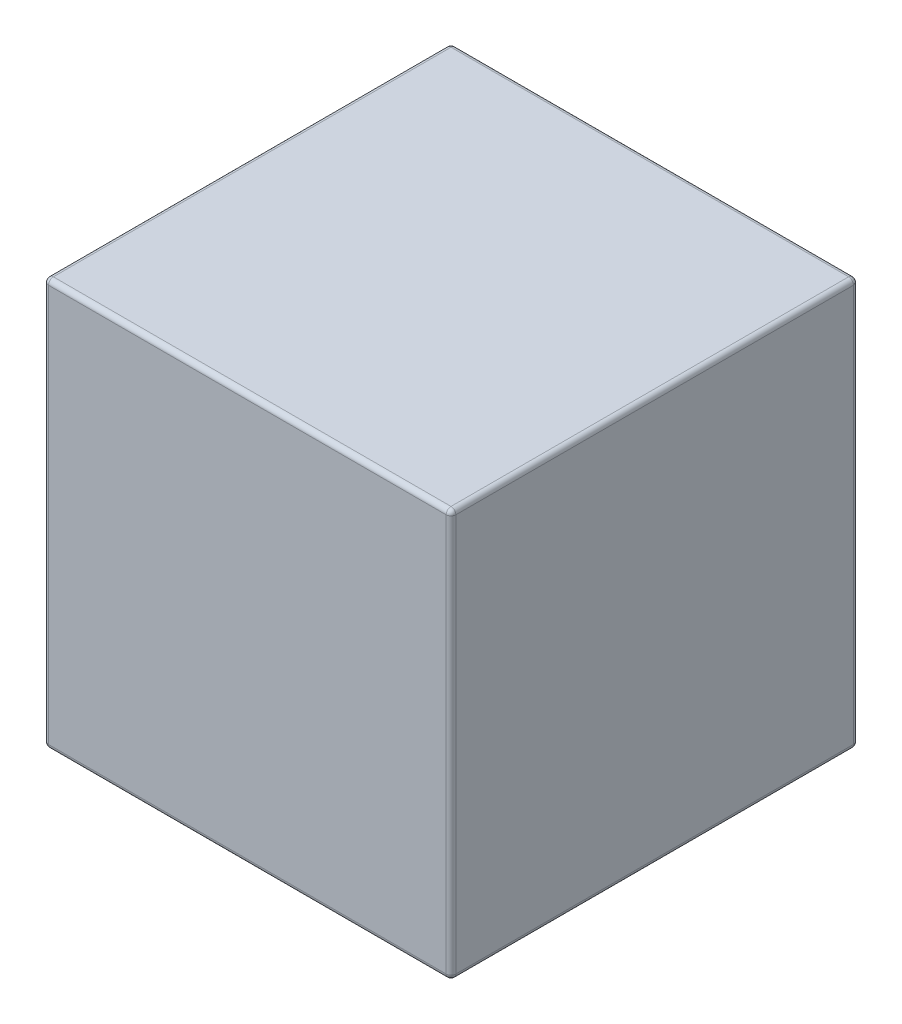
ISO-10303-21;
HEADER;
FILE_DESCRIPTION(('STEP AP214'),'2;1');
FILE_NAME('part.step','',(''),(''),'','','');
FILE_SCHEMA(('AUTOMOTIVE_DESIGN { 1 0 10303 214 1 1 1 1 }'));
ENDSEC;
DATA;
#1=APPLICATION_CONTEXT('core data for automotive mechanical design processes');
#2=APPLICATION_PROTOCOL_DEFINITION('international standard','automotive_design',2000,#1);
#3=PRODUCT_CONTEXT('',#1,'mechanical');
#4=PRODUCT('Part','Part','',(#3));
#5=PRODUCT_RELATED_PRODUCT_CATEGORY('part','',(#4));
#6=PRODUCT_DEFINITION_FORMATION('','',#4);
#7=PRODUCT_DEFINITION_CONTEXT('part definition',#1,'design');
#8=PRODUCT_DEFINITION('design','',#6,#7);
#9=PRODUCT_DEFINITION_SHAPE('','',#8);
#10=(LENGTH_UNIT() NAMED_UNIT(*) SI_UNIT(.MILLI.,.METRE.));
#11=(NAMED_UNIT(*) PLANE_ANGLE_UNIT() SI_UNIT($,.RADIAN.));
#12=(NAMED_UNIT(*) SI_UNIT($,.STERADIAN.) SOLID_ANGLE_UNIT());
#13=UNCERTAINTY_MEASURE_WITH_UNIT(LENGTH_MEASURE(1.E-05),#10,'distance_accuracy_value','');
#14=(GEOMETRIC_REPRESENTATION_CONTEXT(3) GLOBAL_UNCERTAINTY_ASSIGNED_CONTEXT((#13)) GLOBAL_UNIT_ASSIGNED_CONTEXT((#10,
#11,#12)) REPRESENTATION_CONTEXT('',''));
#15=CARTESIAN_POINT('',(0.,0.,0.));
#16=DIRECTION('',(0.,0.,1.));
#17=DIRECTION('',(1.,0.,0.));
#18=AXIS2_PLACEMENT_3D('',#15,#16,#17);
#19=CARTESIAN_POINT('',(-21.,-21.,42.));
#20=DIRECTION('',(1.,0.,0.));
#21=DIRECTION('',(0.,0.,-1.));
#22=AXIS2_PLACEMENT_3D('',#19,#20,#21);
#23=PLANE('',#22);
#24=DIRECTION('',(0.,-1.,0.));
#25=VECTOR('',#24,1.);
#26=CARTESIAN_POINT('',(-21.,21.,41.5));
#27=LINE('',#26,#25);
#28=CARTESIAN_POINT('',(-21.,-20.5,41.5));
#29=VERTEX_POINT('',#28);
#30=CARTESIAN_POINT('',(-21.,20.5,41.5));
#31=VERTEX_POINT('',#30);
#32=EDGE_CURVE('E162',#29,#31,#27,.F.);
#33=ORIENTED_EDGE('',*,*,#32,.T.);
#34=DIRECTION('',(0.,0.,-1.));
#35=VECTOR('',#34,1.);
#36=CARTESIAN_POINT('',(-21.,20.5,42.));
#37=LINE('',#36,#35);
#38=CARTESIAN_POINT('',(-21.,20.5,0.5));
#39=VERTEX_POINT('',#38);
#40=EDGE_CURVE('E133',#31,#39,#37,.T.);
#41=ORIENTED_EDGE('',*,*,#40,.T.);
#42=DIRECTION('',(0.,-1.,0.));
#43=VECTOR('',#42,1.);
#44=CARTESIAN_POINT('',(-21.,-21.,0.5));
#45=LINE('',#44,#43);
#46=CARTESIAN_POINT('',(-21.,-20.5,0.5));
#47=VERTEX_POINT('',#46);
#48=EDGE_CURVE('E152',#39,#47,#45,.T.);
#49=ORIENTED_EDGE('',*,*,#48,.T.);
#50=DIRECTION('',(0.,0.,-1.));
#51=VECTOR('',#50,1.);
#52=CARTESIAN_POINT('',(-21.,-20.5,42.));
#53=LINE('',#52,#51);
#54=EDGE_CURVE('E159',#47,#29,#53,.F.);
#55=ORIENTED_EDGE('',*,*,#54,.T.);
#56=EDGE_LOOP('',(#33,#41,#49,#55));
#57=FACE_BOUND('',#56,.T.);
#58=ADVANCED_FACE('F39',(#57),#23,.F.);
#59=CARTESIAN_POINT('',(21.,-21.,42.));
#60=DIRECTION('',(0.,1.,0.));
#61=DIRECTION('',(-1.,0.,0.));
#62=AXIS2_PLACEMENT_3D('',#59,#60,#61);
#63=PLANE('',#62);
#64=DIRECTION('',(1.,0.,0.));
#65=VECTOR('',#64,1.);
#66=CARTESIAN_POINT('',(-21.,-21.,41.5));
#67=LINE('',#66,#65);
#68=CARTESIAN_POINT('',(20.5,-21.,41.5));
#69=VERTEX_POINT('',#68);
#70=CARTESIAN_POINT('',(-20.5,-21.,41.5));
#71=VERTEX_POINT('',#70);
#72=EDGE_CURVE('E200',#69,#71,#67,.F.);
#73=ORIENTED_EDGE('',*,*,#72,.T.);
#74=DIRECTION('',(0.,0.,-1.));
#75=VECTOR('',#74,1.);
#76=CARTESIAN_POINT('',(-20.5,-21.,42.));
#77=LINE('',#76,#75);
#78=CARTESIAN_POINT('',(-20.5,-21.,0.5));
#79=VERTEX_POINT('',#78);
#80=EDGE_CURVE('E203',#71,#79,#77,.T.);
#81=ORIENTED_EDGE('',*,*,#80,.T.);
#82=DIRECTION('',(1.,0.,0.));
#83=VECTOR('',#82,1.);
#84=CARTESIAN_POINT('',(21.,-21.,0.5));
#85=LINE('',#84,#83);
#86=CARTESIAN_POINT('',(20.5,-21.,0.5));
#87=VERTEX_POINT('',#86);
#88=EDGE_CURVE('E197',#79,#87,#85,.T.);
#89=ORIENTED_EDGE('',*,*,#88,.T.);
#90=DIRECTION('',(0.,0.,-1.));
#91=VECTOR('',#90,1.);
#92=CARTESIAN_POINT('',(20.5,-21.,42.));
#93=LINE('',#92,#91);
#94=EDGE_CURVE('E194',#87,#69,#93,.F.);
#95=ORIENTED_EDGE('',*,*,#94,.T.);
#96=EDGE_LOOP('',(#73,#81,#89,#95));
#97=FACE_BOUND('',#96,.T.);
#98=ADVANCED_FACE('F330',(#97),#63,.F.);
#99=CARTESIAN_POINT('',(21.,-21.,42.));
#100=DIRECTION('',(-1.,0.,0.));
#101=DIRECTION('',(0.,0.,1.));
#102=AXIS2_PLACEMENT_3D('',#99,#100,#101);
#103=PLANE('',#102);
#104=DIRECTION('',(0.,1.,0.));
#105=VECTOR('',#104,1.);
#106=CARTESIAN_POINT('',(21.,-21.,41.5));
#107=LINE('',#106,#105);
#108=CARTESIAN_POINT('',(21.,20.5,41.5));
#109=VERTEX_POINT('',#108);
#110=CARTESIAN_POINT('',(21.,-20.5,41.5));
#111=VERTEX_POINT('',#110);
#112=EDGE_CURVE('E49',#109,#111,#107,.F.);
#113=ORIENTED_EDGE('',*,*,#112,.T.);
#114=DIRECTION('',(0.,0.,-1.));
#115=VECTOR('',#114,1.);
#116=CARTESIAN_POINT('',(21.,-20.5,42.));
#117=LINE('',#116,#115);
#118=CARTESIAN_POINT('',(21.,-20.5,0.5));
#119=VERTEX_POINT('',#118);
#120=EDGE_CURVE('E11',#111,#119,#117,.T.);
#121=ORIENTED_EDGE('',*,*,#120,.T.);
#122=DIRECTION('',(0.,1.,0.));
#123=VECTOR('',#122,1.);
#124=CARTESIAN_POINT('',(21.,-21.,0.5));
#125=LINE('',#124,#123);
#126=CARTESIAN_POINT('',(21.,20.5,0.5));
#127=VERTEX_POINT('',#126);
#128=EDGE_CURVE('E220',#119,#127,#125,.T.);
#129=ORIENTED_EDGE('',*,*,#128,.T.);
#130=DIRECTION('',(0.,0.,-1.));
#131=VECTOR('',#130,1.);
#132=CARTESIAN_POINT('',(21.,20.5,42.));
#133=LINE('',#132,#131);
#134=EDGE_CURVE('E60',#127,#109,#133,.F.);
#135=ORIENTED_EDGE('',*,*,#134,.T.);
#136=EDGE_LOOP('',(#113,#121,#129,#135));
#137=FACE_BOUND('',#136,.T.);
#138=ADVANCED_FACE('F342',(#137),#103,.F.);
#139=CARTESIAN_POINT('',(21.,21.,42.));
#140=DIRECTION('',(0.,-1.,0.));
#141=DIRECTION('',(1.,0.,0.));
#142=AXIS2_PLACEMENT_3D('',#139,#140,#141);
#143=PLANE('',#142);
#144=DIRECTION('',(-1.,0.,0.));
#145=VECTOR('',#144,1.);
#146=CARTESIAN_POINT('',(21.,21.,0.5));
#147=LINE('',#146,#145);
#148=CARTESIAN_POINT('',(20.5,21.,0.5));
#149=VERTEX_POINT('',#148);
#150=CARTESIAN_POINT('',(-20.5,21.,0.5));
#151=VERTEX_POINT('',#150);
#152=EDGE_CURVE('E169',#149,#151,#147,.T.);
#153=ORIENTED_EDGE('',*,*,#152,.T.);
#154=DIRECTION('',(0.,0.,-1.));
#155=VECTOR('',#154,1.);
#156=CARTESIAN_POINT('',(-20.5,21.,42.));
#157=LINE('',#156,#155);
#158=CARTESIAN_POINT('',(-20.5,21.,41.5));
#159=VERTEX_POINT('',#158);
#160=EDGE_CURVE('E135',#151,#159,#157,.F.);
#161=ORIENTED_EDGE('',*,*,#160,.T.);
#162=DIRECTION('',(-1.,0.,0.));
#163=VECTOR('',#162,1.);
#164=CARTESIAN_POINT('',(21.,21.,41.5));
#165=LINE('',#164,#163);
#166=CARTESIAN_POINT('',(20.5,21.,41.5));
#167=VERTEX_POINT('',#166);
#168=EDGE_CURVE('E176',#159,#167,#165,.F.);
#169=ORIENTED_EDGE('',*,*,#168,.T.);
#170=DIRECTION('',(0.,0.,-1.));
#171=VECTOR('',#170,1.);
#172=CARTESIAN_POINT('',(20.5,21.,42.));
#173=LINE('',#172,#171);
#174=EDGE_CURVE('E165',#167,#149,#173,.T.);
#175=ORIENTED_EDGE('',*,*,#174,.T.);
#176=EDGE_LOOP('',(#153,#161,#169,#175));
#177=FACE_BOUND('',#176,.T.);
#178=ADVANCED_FACE('F359',(#177),#143,.F.);
#179=CARTESIAN_POINT('',(0.,0.,42.));
#180=DIRECTION('',(0.,0.,1.));
#181=DIRECTION('',(1.,0.,0.));
#182=AXIS2_PLACEMENT_3D('',#179,#180,#181);
#183=PLANE('',#182);
#184=DIRECTION('',(0.,1.,0.));
#185=VECTOR('',#184,1.);
#186=CARTESIAN_POINT('',(20.5,21.,42.));
#187=LINE('',#186,#185);
#188=CARTESIAN_POINT('',(20.5,-20.5,42.));
#189=VERTEX_POINT('',#188);
#190=CARTESIAN_POINT('',(20.5,20.5,42.));
#191=VERTEX_POINT('',#190);
#192=EDGE_CURVE('E181',#189,#191,#187,.T.);
#193=ORIENTED_EDGE('',*,*,#192,.T.);
#194=DIRECTION('',(-1.,0.,0.));
#195=VECTOR('',#194,1.);
#196=CARTESIAN_POINT('',(-21.,20.5,42.));
#197=LINE('',#196,#195);
#198=CARTESIAN_POINT('',(-20.5,20.5,42.));
#199=VERTEX_POINT('',#198);
#200=EDGE_CURVE('E190',#191,#199,#197,.T.);
#201=ORIENTED_EDGE('',*,*,#200,.T.);
#202=DIRECTION('',(0.,-1.,0.));
#203=VECTOR('',#202,1.);
#204=CARTESIAN_POINT('',(-20.5,-21.,42.));
#205=LINE('',#204,#203);
#206=CARTESIAN_POINT('',(-20.5,-20.5,42.));
#207=VERTEX_POINT('',#206);
#208=EDGE_CURVE('E187',#199,#207,#205,.T.);
#209=ORIENTED_EDGE('',*,*,#208,.T.);
#210=DIRECTION('',(1.,0.,0.));
#211=VECTOR('',#210,1.);
#212=CARTESIAN_POINT('',(21.,-20.5,42.));
#213=LINE('',#212,#211);
#214=EDGE_CURVE('E184',#207,#189,#213,.T.);
#215=ORIENTED_EDGE('',*,*,#214,.T.);
#216=EDGE_LOOP('',(#193,#201,#209,#215));
#217=FACE_BOUND('',#216,.T.);
#218=ADVANCED_FACE('F321',(#217),#183,.T.);
#219=CARTESIAN_POINT('',(0.,0.,0.));
#220=DIRECTION('',(0.,0.,1.));
#221=DIRECTION('',(1.,0.,0.));
#222=AXIS2_PLACEMENT_3D('',#219,#220,#221);
#223=PLANE('',#222);
#224=DIRECTION('',(1.,0.,0.));
#225=VECTOR('',#224,1.);
#226=CARTESIAN_POINT('',(0.,-20.5,0.));
#227=LINE('',#226,#225);
#228=CARTESIAN_POINT('',(20.5,-20.5,0.));
#229=VERTEX_POINT('',#228);
#230=CARTESIAN_POINT('',(-20.5,-20.5,0.));
#231=VERTEX_POINT('',#230);
#232=EDGE_CURVE('E213',#229,#231,#227,.F.);
#233=ORIENTED_EDGE('',*,*,#232,.T.);
#234=DIRECTION('',(0.,-1.,0.));
#235=VECTOR('',#234,1.);
#236=CARTESIAN_POINT('',(-20.5,0.,0.));
#237=LINE('',#236,#235);
#238=CARTESIAN_POINT('',(-20.5,20.5,0.));
#239=VERTEX_POINT('',#238);
#240=EDGE_CURVE('E217',#231,#239,#237,.F.);
#241=ORIENTED_EDGE('',*,*,#240,.T.);
#242=DIRECTION('',(-1.,0.,0.));
#243=VECTOR('',#242,1.);
#244=CARTESIAN_POINT('',(0.,20.5,0.));
#245=LINE('',#244,#243);
#246=CARTESIAN_POINT('',(20.5,20.5,0.));
#247=VERTEX_POINT('',#246);
#248=EDGE_CURVE('E210',#239,#247,#245,.F.);
#249=ORIENTED_EDGE('',*,*,#248,.T.);
#250=DIRECTION('',(0.,1.,0.));
#251=VECTOR('',#250,1.);
#252=CARTESIAN_POINT('',(20.5,0.,0.));
#253=LINE('',#252,#251);
#254=EDGE_CURVE('E207',#247,#229,#253,.F.);
#255=ORIENTED_EDGE('',*,*,#254,.T.);
#256=EDGE_LOOP('',(#233,#241,#249,#255));
#257=FACE_BOUND('',#256,.T.);
#258=ADVANCED_FACE('F530',(#257),#223,.F.);
#259=CARTESIAN_POINT('',(20.5,-20.5,42.));
#260=DIRECTION('',(0.,0.,-1.));
#261=DIRECTION('',(-1.,0.,0.));
#262=AXIS2_PLACEMENT_3D('',#259,#260,#261);
#263=CYLINDRICAL_SURFACE('',#262,0.5);
#264=CARTESIAN_POINT('',(20.5,-20.5,41.5));
#265=DIRECTION('',(0.,0.,1.));
#266=DIRECTION('',(1.,0.,0.));
#267=AXIS2_PLACEMENT_3D('',#264,#265,#266);
#268=CIRCLE('',#267,0.5);
#269=EDGE_CURVE('E43',#69,#111,#268,.T.);
#270=ORIENTED_EDGE('',*,*,#269,.F.);
#271=ORIENTED_EDGE('',*,*,#94,.F.);
#272=CARTESIAN_POINT('',(20.5,-20.5,0.5));
#273=DIRECTION('',(0.,0.,-1.));
#274=DIRECTION('',(-1.,0.,0.));
#275=AXIS2_PLACEMENT_3D('',#272,#273,#274);
#276=CIRCLE('',#275,0.5);
#277=EDGE_CURVE('E297',#119,#87,#276,.T.);
#278=ORIENTED_EDGE('',*,*,#277,.F.);
#279=ORIENTED_EDGE('',*,*,#120,.F.);
#280=EDGE_LOOP('',(#270,#271,#278,#279));
#281=FACE_BOUND('',#280,.T.);
#282=ADVANCED_FACE('F41',(#281),#263,.T.);
#283=CARTESIAN_POINT('',(20.5,-20.5,41.5));
#284=DIRECTION('',(0.,0.,1.));
#285=DIRECTION('',(1.,0.,0.));
#286=AXIS2_PLACEMENT_3D('',#283,#284,#285);
#287=SPHERICAL_SURFACE('',#286,0.5);
#288=CARTESIAN_POINT('',(20.5,-20.5,41.5));
#289=DIRECTION('',(1.,0.,0.));
#290=DIRECTION('',(0.,0.,-1.));
#291=AXIS2_PLACEMENT_3D('',#288,#289,#290);
#292=CIRCLE('',#291,0.5);
#293=EDGE_CURVE('E290',#69,#189,#292,.F.);
#294=ORIENTED_EDGE('',*,*,#293,.F.);
#295=ORIENTED_EDGE('',*,*,#269,.T.);
#296=CARTESIAN_POINT('',(20.5,-20.5,41.5));
#297=DIRECTION('',(0.,-1.,0.));
#298=DIRECTION('',(0.,0.,-1.));
#299=AXIS2_PLACEMENT_3D('',#296,#297,#298);
#300=CIRCLE('',#299,0.5);
#301=EDGE_CURVE('E294',#189,#111,#300,.F.);
#302=ORIENTED_EDGE('',*,*,#301,.F.);
#303=EDGE_LOOP('',(#294,#295,#302));
#304=FACE_BOUND('',#303,.T.);
#305=ADVANCED_FACE('F310',(#304),#287,.T.);
#306=CARTESIAN_POINT('',(20.5,-20.5,0.5));
#307=DIRECTION('',(0.,0.,1.));
#308=DIRECTION('',(1.,0.,0.));
#309=AXIS2_PLACEMENT_3D('',#306,#307,#308);
#310=SPHERICAL_SURFACE('',#309,0.5);
#311=CARTESIAN_POINT('',(20.5,-20.5,0.5));
#312=DIRECTION('',(0.,-1.,0.));
#313=DIRECTION('',(0.,0.,-1.));
#314=AXIS2_PLACEMENT_3D('',#311,#312,#313);
#315=CIRCLE('',#314,0.5);
#316=EDGE_CURVE('E282',#119,#229,#315,.F.);
#317=ORIENTED_EDGE('',*,*,#316,.F.);
#318=ORIENTED_EDGE('',*,*,#277,.T.);
#319=CARTESIAN_POINT('',(20.5,-20.5,0.5));
#320=DIRECTION('',(1.,0.,0.));
#321=DIRECTION('',(0.,0.,-1.));
#322=AXIS2_PLACEMENT_3D('',#319,#320,#321);
#323=CIRCLE('',#322,0.5);
#324=EDGE_CURVE('E286',#229,#87,#323,.F.);
#325=ORIENTED_EDGE('',*,*,#324,.F.);
#326=EDGE_LOOP('',(#317,#318,#325));
#327=FACE_BOUND('',#326,.T.);
#328=ADVANCED_FACE('F509',(#327),#310,.T.);
#329=CARTESIAN_POINT('',(20.5,0.,41.5));
#330=DIRECTION('',(0.,-1.,0.));
#331=DIRECTION('',(0.,0.,-1.));
#332=AXIS2_PLACEMENT_3D('',#329,#330,#331);
#333=CYLINDRICAL_SURFACE('',#332,0.5);
#334=ORIENTED_EDGE('',*,*,#301,.T.);
#335=ORIENTED_EDGE('',*,*,#112,.F.);
#336=CARTESIAN_POINT('',(20.5,20.5,41.5));
#337=DIRECTION('',(0.,1.,0.));
#338=DIRECTION('',(0.,0.,1.));
#339=AXIS2_PLACEMENT_3D('',#336,#337,#338);
#340=CIRCLE('',#339,0.5);
#341=EDGE_CURVE('E274',#191,#109,#340,.T.);
#342=ORIENTED_EDGE('',*,*,#341,.F.);
#343=ORIENTED_EDGE('',*,*,#192,.F.);
#344=EDGE_LOOP('',(#334,#335,#342,#343));
#345=FACE_BOUND('',#344,.T.);
#346=ADVANCED_FACE('F316',(#345),#333,.T.);
#347=CARTESIAN_POINT('',(0.,-20.5,41.5));
#348=DIRECTION('',(-1.,0.,0.));
#349=DIRECTION('',(0.,-1.,0.));
#350=AXIS2_PLACEMENT_3D('',#347,#348,#349);
#351=CYLINDRICAL_SURFACE('',#350,0.5);
#352=ORIENTED_EDGE('',*,*,#293,.T.);
#353=ORIENTED_EDGE('',*,*,#214,.F.);
#354=CARTESIAN_POINT('',(-20.5,-20.5,41.5));
#355=DIRECTION('',(-1.,0.,0.));
#356=DIRECTION('',(0.,0.,1.));
#357=AXIS2_PLACEMENT_3D('',#354,#355,#356);
#358=CIRCLE('',#357,0.5);
#359=EDGE_CURVE('E270',#71,#207,#358,.T.);
#360=ORIENTED_EDGE('',*,*,#359,.F.);
#361=ORIENTED_EDGE('',*,*,#72,.F.);
#362=EDGE_LOOP('',(#352,#353,#360,#361));
#363=FACE_BOUND('',#362,.T.);
#364=ADVANCED_FACE('F327',(#363),#351,.T.);
#365=CARTESIAN_POINT('',(-20.5,-20.5,42.));
#366=DIRECTION('',(0.,0.,-1.));
#367=DIRECTION('',(-1.,0.,0.));
#368=AXIS2_PLACEMENT_3D('',#365,#366,#367);
#369=CYLINDRICAL_SURFACE('',#368,0.5);
#370=CARTESIAN_POINT('',(-20.5,-20.5,0.5));
#371=DIRECTION('',(0.,0.,-1.));
#372=DIRECTION('',(-1.,0.,0.));
#373=AXIS2_PLACEMENT_3D('',#370,#371,#372);
#374=CIRCLE('',#373,0.5);
#375=EDGE_CURVE('E262',#79,#47,#374,.T.);
#376=ORIENTED_EDGE('',*,*,#375,.F.);
#377=ORIENTED_EDGE('',*,*,#80,.F.);
#378=CARTESIAN_POINT('',(-20.5,-20.5,41.5));
#379=DIRECTION('',(0.,0.,1.));
#380=DIRECTION('',(1.,0.,0.));
#381=AXIS2_PLACEMENT_3D('',#378,#379,#380);
#382=CIRCLE('',#381,0.5);
#383=EDGE_CURVE('E266',#29,#71,#382,.T.);
#384=ORIENTED_EDGE('',*,*,#383,.F.);
#385=ORIENTED_EDGE('',*,*,#54,.F.);
#386=EDGE_LOOP('',(#376,#377,#384,#385));
#387=FACE_BOUND('',#386,.T.);
#388=ADVANCED_FACE('F334',(#387),#369,.T.);
#389=CARTESIAN_POINT('',(21.,-20.5,0.5));
#390=DIRECTION('',(1.,0.,0.));
#391=DIRECTION('',(0.,1.,0.));
#392=AXIS2_PLACEMENT_3D('',#389,#390,#391);
#393=CYLINDRICAL_SURFACE('',#392,0.5);
#394=ORIENTED_EDGE('',*,*,#324,.T.);
#395=ORIENTED_EDGE('',*,*,#88,.F.);
#396=CARTESIAN_POINT('',(-20.5,-20.5,0.5));
#397=DIRECTION('',(-1.,0.,0.));
#398=DIRECTION('',(0.,0.,1.));
#399=AXIS2_PLACEMENT_3D('',#396,#397,#398);
#400=CIRCLE('',#399,0.5);
#401=EDGE_CURVE('E259',#231,#79,#400,.T.);
#402=ORIENTED_EDGE('',*,*,#401,.F.);
#403=ORIENTED_EDGE('',*,*,#232,.F.);
#404=EDGE_LOOP('',(#394,#395,#402,#403));
#405=FACE_BOUND('',#404,.T.);
#406=ADVANCED_FACE('F340',(#405),#393,.T.);
#407=CARTESIAN_POINT('',(20.5,-21.,0.5));
#408=DIRECTION('',(0.,1.,0.));
#409=DIRECTION('',(0.,0.,1.));
#410=AXIS2_PLACEMENT_3D('',#407,#408,#409);
#411=CYLINDRICAL_SURFACE('',#410,0.5);
#412=ORIENTED_EDGE('',*,*,#316,.T.);
#413=ORIENTED_EDGE('',*,*,#254,.F.);
#414=CARTESIAN_POINT('',(20.5,20.5,0.5));
#415=DIRECTION('',(0.,1.,0.));
#416=DIRECTION('',(0.,0.,1.));
#417=AXIS2_PLACEMENT_3D('',#414,#415,#416);
#418=CIRCLE('',#417,0.5);
#419=EDGE_CURVE('E255',#127,#247,#418,.T.);
#420=ORIENTED_EDGE('',*,*,#419,.F.);
#421=ORIENTED_EDGE('',*,*,#128,.F.);
#422=EDGE_LOOP('',(#412,#413,#420,#421));
#423=FACE_BOUND('',#422,.T.);
#424=ADVANCED_FACE('F351',(#423),#411,.T.);
#425=CARTESIAN_POINT('',(20.5,20.5,42.));
#426=DIRECTION('',(0.,0.,-1.));
#427=DIRECTION('',(-1.,0.,0.));
#428=AXIS2_PLACEMENT_3D('',#425,#426,#427);
#429=CYLINDRICAL_SURFACE('',#428,0.5);
#430=CARTESIAN_POINT('',(20.5,20.5,41.5));
#431=DIRECTION('',(0.,0.,1.));
#432=DIRECTION('',(1.,0.,0.));
#433=AXIS2_PLACEMENT_3D('',#430,#431,#432);
#434=CIRCLE('',#433,0.5);
#435=EDGE_CURVE('E278',#109,#167,#434,.T.);
#436=ORIENTED_EDGE('',*,*,#435,.F.);
#437=ORIENTED_EDGE('',*,*,#134,.F.);
#438=CARTESIAN_POINT('',(20.5,20.5,0.5));
#439=DIRECTION('',(0.,0.,-1.));
#440=DIRECTION('',(-1.,0.,0.));
#441=AXIS2_PLACEMENT_3D('',#438,#439,#440);
#442=CIRCLE('',#441,0.5);
#443=EDGE_CURVE('E251',#149,#127,#442,.T.);
#444=ORIENTED_EDGE('',*,*,#443,.F.);
#445=ORIENTED_EDGE('',*,*,#174,.F.);
#446=EDGE_LOOP('',(#436,#437,#444,#445));
#447=FACE_BOUND('',#446,.T.);
#448=ADVANCED_FACE('F347',(#447),#429,.T.);
#449=CARTESIAN_POINT('',(20.5,20.5,41.5));
#450=DIRECTION('',(0.,0.,1.));
#451=DIRECTION('',(1.,0.,0.));
#452=AXIS2_PLACEMENT_3D('',#449,#450,#451);
#453=SPHERICAL_SURFACE('',#452,0.5);
#454=ORIENTED_EDGE('',*,*,#341,.T.);
#455=ORIENTED_EDGE('',*,*,#435,.T.);
#456=CARTESIAN_POINT('',(20.5,20.5,41.5));
#457=DIRECTION('',(1.,0.,0.));
#458=DIRECTION('',(0.,0.,-1.));
#459=AXIS2_PLACEMENT_3D('',#456,#457,#458);
#460=CIRCLE('',#459,0.5);
#461=EDGE_CURVE('E247',#191,#167,#460,.F.);
#462=ORIENTED_EDGE('',*,*,#461,.F.);
#463=EDGE_LOOP('',(#454,#455,#462));
#464=FACE_BOUND('',#463,.T.);
#465=ADVANCED_FACE('F362',(#464),#453,.T.);
#466=CARTESIAN_POINT('',(-20.5,-20.5,41.5));
#467=DIRECTION('',(0.,0.,1.));
#468=DIRECTION('',(1.,0.,0.));
#469=AXIS2_PLACEMENT_3D('',#466,#467,#468);
#470=SPHERICAL_SURFACE('',#469,0.5);
#471=ORIENTED_EDGE('',*,*,#383,.T.);
#472=ORIENTED_EDGE('',*,*,#359,.T.);
#473=CARTESIAN_POINT('',(-20.5,-20.5,41.5));
#474=DIRECTION('',(0.,-1.,0.));
#475=DIRECTION('',(0.,0.,-1.));
#476=AXIS2_PLACEMENT_3D('',#473,#474,#475);
#477=CIRCLE('',#476,0.5);
#478=EDGE_CURVE('E243',#29,#207,#477,.F.);
#479=ORIENTED_EDGE('',*,*,#478,.F.);
#480=EDGE_LOOP('',(#471,#472,#479));
#481=FACE_BOUND('',#480,.T.);
#482=ADVANCED_FACE('F371',(#481),#470,.T.);
#483=CARTESIAN_POINT('',(-20.5,-20.5,0.5));
#484=DIRECTION('',(0.,0.,1.));
#485=DIRECTION('',(1.,0.,0.));
#486=AXIS2_PLACEMENT_3D('',#483,#484,#485);
#487=SPHERICAL_SURFACE('',#486,0.5);
#488=ORIENTED_EDGE('',*,*,#401,.T.);
#489=ORIENTED_EDGE('',*,*,#375,.T.);
#490=CARTESIAN_POINT('',(-20.5,-20.5,0.5));
#491=DIRECTION('',(0.,-1.,0.));
#492=DIRECTION('',(0.,0.,-1.));
#493=AXIS2_PLACEMENT_3D('',#490,#491,#492);
#494=CIRCLE('',#493,0.5);
#495=EDGE_CURVE('E155',#231,#47,#494,.F.);
#496=ORIENTED_EDGE('',*,*,#495,.F.);
#497=EDGE_LOOP('',(#488,#489,#496));
#498=FACE_BOUND('',#497,.T.);
#499=ADVANCED_FACE('F373',(#498),#487,.T.);
#500=CARTESIAN_POINT('',(20.5,20.5,0.5));
#501=DIRECTION('',(0.,0.,1.));
#502=DIRECTION('',(1.,0.,0.));
#503=AXIS2_PLACEMENT_3D('',#500,#501,#502);
#504=SPHERICAL_SURFACE('',#503,0.5);
#505=ORIENTED_EDGE('',*,*,#443,.T.);
#506=ORIENTED_EDGE('',*,*,#419,.T.);
#507=CARTESIAN_POINT('',(20.5,20.5,0.5));
#508=DIRECTION('',(1.,0.,0.));
#509=DIRECTION('',(0.,0.,-1.));
#510=AXIS2_PLACEMENT_3D('',#507,#508,#509);
#511=CIRCLE('',#510,0.5);
#512=EDGE_CURVE('E237',#149,#247,#511,.F.);
#513=ORIENTED_EDGE('',*,*,#512,.F.);
#514=EDGE_LOOP('',(#505,#506,#513));
#515=FACE_BOUND('',#514,.T.);
#516=ADVANCED_FACE('F353',(#515),#504,.T.);
#517=CARTESIAN_POINT('',(0.,20.5,41.5));
#518=DIRECTION('',(1.,0.,0.));
#519=DIRECTION('',(0.,1.,0.));
#520=AXIS2_PLACEMENT_3D('',#517,#518,#519);
#521=CYLINDRICAL_SURFACE('',#520,0.5);
#522=ORIENTED_EDGE('',*,*,#461,.T.);
#523=ORIENTED_EDGE('',*,*,#168,.F.);
#524=CARTESIAN_POINT('',(-20.5,20.5,41.5));
#525=DIRECTION('',(-1.,0.,0.));
#526=DIRECTION('',(0.,0.,1.));
#527=AXIS2_PLACEMENT_3D('',#524,#525,#526);
#528=CIRCLE('',#527,0.5);
#529=EDGE_CURVE('E233',#199,#159,#528,.T.);
#530=ORIENTED_EDGE('',*,*,#529,.F.);
#531=ORIENTED_EDGE('',*,*,#200,.F.);
#532=EDGE_LOOP('',(#522,#523,#530,#531));
#533=FACE_BOUND('',#532,.T.);
#534=ADVANCED_FACE('F364',(#533),#521,.T.);
#535=CARTESIAN_POINT('',(-20.5,0.,41.5));
#536=DIRECTION('',(0.,1.,0.));
#537=DIRECTION('',(0.,0.,1.));
#538=AXIS2_PLACEMENT_3D('',#535,#536,#537);
#539=CYLINDRICAL_SURFACE('',#538,0.5);
#540=ORIENTED_EDGE('',*,*,#478,.T.);
#541=ORIENTED_EDGE('',*,*,#208,.F.);
#542=CARTESIAN_POINT('',(-20.5,20.5,41.5));
#543=DIRECTION('',(0.,1.,0.));
#544=DIRECTION('',(0.,0.,1.));
#545=AXIS2_PLACEMENT_3D('',#542,#543,#544);
#546=CIRCLE('',#545,0.5);
#547=EDGE_CURVE('E149',#31,#199,#546,.T.);
#548=ORIENTED_EDGE('',*,*,#547,.F.);
#549=ORIENTED_EDGE('',*,*,#32,.F.);
#550=EDGE_LOOP('',(#540,#541,#548,#549));
#551=FACE_BOUND('',#550,.T.);
#552=ADVANCED_FACE('F369',(#551),#539,.T.);
#553=CARTESIAN_POINT('',(-20.5,-21.,0.5));
#554=DIRECTION('',(0.,-1.,0.));
#555=DIRECTION('',(0.,0.,-1.));
#556=AXIS2_PLACEMENT_3D('',#553,#554,#555);
#557=CYLINDRICAL_SURFACE('',#556,0.5);
#558=ORIENTED_EDGE('',*,*,#495,.T.);
#559=ORIENTED_EDGE('',*,*,#48,.F.);
#560=CARTESIAN_POINT('',(-20.5,20.5,0.5));
#561=DIRECTION('',(0.,1.,0.));
#562=DIRECTION('',(-1.,0.,0.));
#563=AXIS2_PLACEMENT_3D('',#560,#561,#562);
#564=CIRCLE('',#563,0.5);
#565=EDGE_CURVE('E142',#239,#39,#564,.T.);
#566=ORIENTED_EDGE('',*,*,#565,.F.);
#567=ORIENTED_EDGE('',*,*,#240,.F.);
#568=EDGE_LOOP('',(#558,#559,#566,#567));
#569=FACE_BOUND('',#568,.T.);
#570=ADVANCED_FACE('F153',(#569),#557,.T.);
#571=CARTESIAN_POINT('',(21.,20.5,0.5));
#572=DIRECTION('',(-1.,0.,0.));
#573=DIRECTION('',(0.,-1.,0.));
#574=AXIS2_PLACEMENT_3D('',#571,#572,#573);
#575=CYLINDRICAL_SURFACE('',#574,0.5);
#576=ORIENTED_EDGE('',*,*,#512,.T.);
#577=ORIENTED_EDGE('',*,*,#248,.F.);
#578=CARTESIAN_POINT('',(-20.5,20.5,0.5));
#579=DIRECTION('',(-1.,0.,0.));
#580=DIRECTION('',(0.,0.,1.));
#581=AXIS2_PLACEMENT_3D('',#578,#579,#580);
#582=CIRCLE('',#581,0.5);
#583=EDGE_CURVE('E146',#151,#239,#582,.T.);
#584=ORIENTED_EDGE('',*,*,#583,.F.);
#585=ORIENTED_EDGE('',*,*,#152,.F.);
#586=EDGE_LOOP('',(#576,#577,#584,#585));
#587=FACE_BOUND('',#586,.T.);
#588=ADVANCED_FACE('F357',(#587),#575,.T.);
#589=CARTESIAN_POINT('',(-20.5,20.5,41.5));
#590=DIRECTION('',(0.,0.,1.));
#591=DIRECTION('',(1.,0.,0.));
#592=AXIS2_PLACEMENT_3D('',#589,#590,#591);
#593=SPHERICAL_SURFACE('',#592,0.5);
#594=ORIENTED_EDGE('',*,*,#547,.T.);
#595=ORIENTED_EDGE('',*,*,#529,.T.);
#596=CARTESIAN_POINT('',(-20.5,20.5,41.5));
#597=DIRECTION('',(0.,0.,1.));
#598=DIRECTION('',(1.,0.,0.));
#599=AXIS2_PLACEMENT_3D('',#596,#597,#598);
#600=CIRCLE('',#599,0.5);
#601=EDGE_CURVE('E139',#31,#159,#600,.F.);
#602=ORIENTED_EDGE('',*,*,#601,.F.);
#603=EDGE_LOOP('',(#594,#595,#602));
#604=FACE_BOUND('',#603,.T.);
#605=ADVANCED_FACE('F393',(#604),#593,.T.);
#606=CARTESIAN_POINT('',(-20.5,20.5,0.5));
#607=DIRECTION('',(0.,0.,1.));
#608=DIRECTION('',(1.,0.,0.));
#609=AXIS2_PLACEMENT_3D('',#606,#607,#608);
#610=SPHERICAL_SURFACE('',#609,0.5);
#611=ORIENTED_EDGE('',*,*,#583,.T.);
#612=ORIENTED_EDGE('',*,*,#565,.T.);
#613=CARTESIAN_POINT('',(-20.5,20.5,0.5));
#614=DIRECTION('',(0.,0.,-1.));
#615=DIRECTION('',(-1.,0.,0.));
#616=AXIS2_PLACEMENT_3D('',#613,#614,#615);
#617=CIRCLE('',#616,0.5);
#618=EDGE_CURVE('E129',#151,#39,#617,.F.);
#619=ORIENTED_EDGE('',*,*,#618,.F.);
#620=EDGE_LOOP('',(#611,#612,#619));
#621=FACE_BOUND('',#620,.T.);
#622=ADVANCED_FACE('F144',(#621),#610,.T.);
#623=CARTESIAN_POINT('',(-20.5,20.5,42.));
#624=DIRECTION('',(0.,0.,-1.));
#625=DIRECTION('',(-1.,0.,0.));
#626=AXIS2_PLACEMENT_3D('',#623,#624,#625);
#627=CYLINDRICAL_SURFACE('',#626,0.5);
#628=ORIENTED_EDGE('',*,*,#601,.T.);
#629=ORIENTED_EDGE('',*,*,#160,.F.);
#630=ORIENTED_EDGE('',*,*,#618,.T.);
#631=ORIENTED_EDGE('',*,*,#40,.F.);
#632=EDGE_LOOP('',(#628,#629,#630,#631));
#633=FACE_BOUND('',#632,.T.);
#634=ADVANCED_FACE('F131',(#633),#627,.T.);
#635=CLOSED_SHELL('',(#58,#98,#138,#178,#218,#258,#282,#305,#328,#346,#364,#388,#406,#424,#448,
#465,#482,#499,#516,#534,#552,#570,#588,#605,#622,#634));
#636=MANIFOLD_SOLID_BREP('B2',#635);
#637=ADVANCED_BREP_SHAPE_REPRESENTATION('',(#18,#636),#14);
#638=SHAPE_DEFINITION_REPRESENTATION(#9,#637);
ENDSEC;
END-ISO-10303-21;
